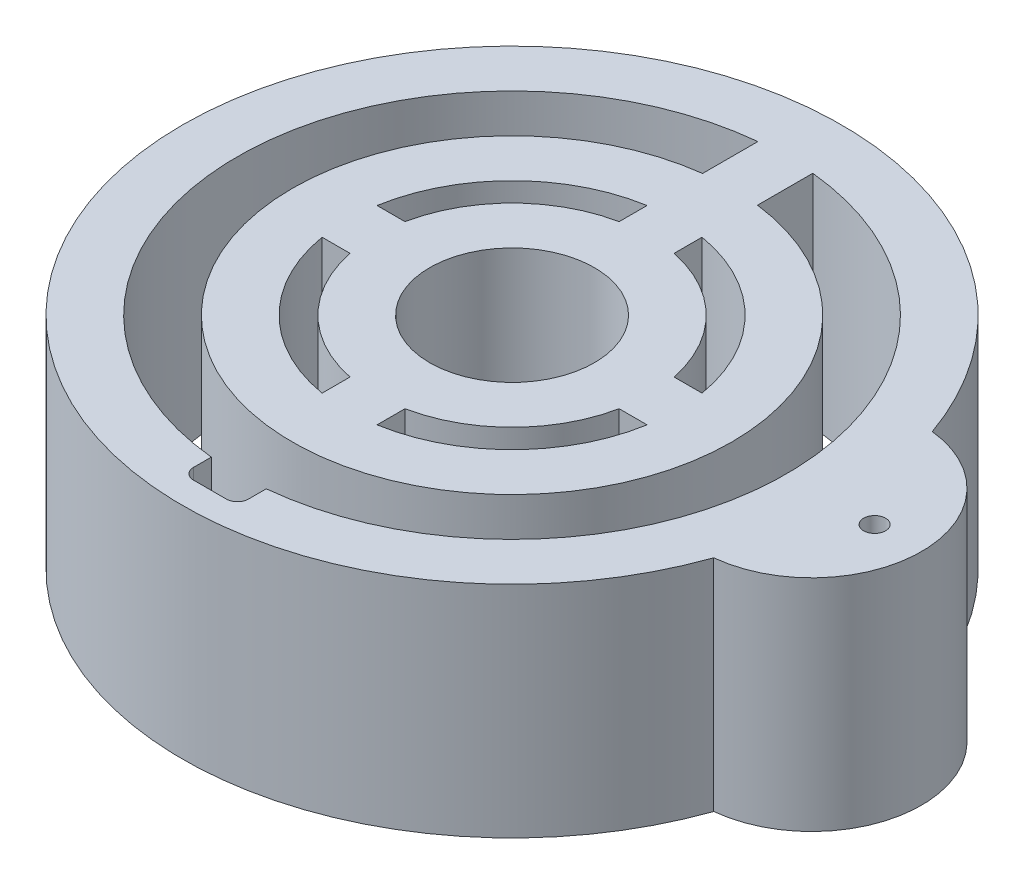
ISO-10303-21;
HEADER;
FILE_DESCRIPTION(('STEP AP214'),'2;1');
FILE_NAME('part.step','',(''),(''),'','','');
FILE_SCHEMA(('AUTOMOTIVE_DESIGN { 1 0 10303 214 1 1 1 1 }'));
ENDSEC;
DATA;
#1=APPLICATION_CONTEXT('core data for automotive mechanical design processes');
#2=APPLICATION_PROTOCOL_DEFINITION('international standard','automotive_design',2000,#1);
#3=PRODUCT_CONTEXT('',#1,'mechanical');
#4=PRODUCT('Part','Part','',(#3));
#5=PRODUCT_RELATED_PRODUCT_CATEGORY('part','',(#4));
#6=PRODUCT_DEFINITION_FORMATION('','',#4);
#7=PRODUCT_DEFINITION_CONTEXT('part definition',#1,'design');
#8=PRODUCT_DEFINITION('design','',#6,#7);
#9=PRODUCT_DEFINITION_SHAPE('','',#8);
#10=(LENGTH_UNIT() NAMED_UNIT(*) SI_UNIT(.MILLI.,.METRE.));
#11=(NAMED_UNIT(*) PLANE_ANGLE_UNIT() SI_UNIT($,.RADIAN.));
#12=(NAMED_UNIT(*) SI_UNIT($,.STERADIAN.) SOLID_ANGLE_UNIT());
#13=UNCERTAINTY_MEASURE_WITH_UNIT(LENGTH_MEASURE(1.E-05),#10,'distance_accuracy_value','');
#14=(GEOMETRIC_REPRESENTATION_CONTEXT(3) GLOBAL_UNCERTAINTY_ASSIGNED_CONTEXT((#13)) GLOBAL_UNIT_ASSIGNED_CONTEXT((#10,
#11,#12)) REPRESENTATION_CONTEXT('',''));
#15=CARTESIAN_POINT('',(0.,0.,0.));
#16=DIRECTION('',(0.,0.,1.));
#17=DIRECTION('',(1.,0.,0.));
#18=AXIS2_PLACEMENT_3D('',#15,#16,#17);
#19=CARTESIAN_POINT('',(0.,20.,0.));
#20=DIRECTION('',(0.,-1.,0.));
#21=DIRECTION('',(0.,0.,-1.));
#22=AXIS2_PLACEMENT_3D('',#19,#20,#21);
#23=CYLINDRICAL_SURFACE('',#22,15.);
#24=CARTESIAN_POINT('',(0.,0.,0.));
#25=DIRECTION('',(0.,1.,0.));
#26=DIRECTION('',(0.,0.,1.));
#27=AXIS2_PLACEMENT_3D('',#24,#25,#26);
#28=CIRCLE('',#27,15.);
#29=CARTESIAN_POINT('',(-2.5,0.,-14.790199457749));
#30=VERTEX_POINT('',#29);
#31=CARTESIAN_POINT('',(-14.790199457749,0.,-2.5));
#32=VERTEX_POINT('',#31);
#33=EDGE_CURVE('E454',#30,#32,#28,.T.);
#34=ORIENTED_EDGE('',*,*,#33,.F.);
#35=DIRECTION('',(0.,-1.,0.));
#36=VECTOR('',#35,1.);
#37=CARTESIAN_POINT('',(-2.5,20.,-14.790199457749));
#38=LINE('',#37,#36);
#39=CARTESIAN_POINT('',(-2.5,20.,-14.790199457749));
#40=VERTEX_POINT('',#39);
#41=EDGE_CURVE('E272',#30,#40,#38,.F.);
#42=ORIENTED_EDGE('',*,*,#41,.T.);
#43=CARTESIAN_POINT('',(0.,20.,0.));
#44=DIRECTION('',(0.,1.,0.));
#45=DIRECTION('',(0.,0.,1.));
#46=AXIS2_PLACEMENT_3D('',#43,#44,#45);
#47=CIRCLE('',#46,15.);
#48=CARTESIAN_POINT('',(-14.790199457749,20.,-2.5));
#49=VERTEX_POINT('',#48);
#50=EDGE_CURVE('E229',#40,#49,#47,.T.);
#51=ORIENTED_EDGE('',*,*,#50,.T.);
#52=DIRECTION('',(0.,-1.,0.));
#53=VECTOR('',#52,1.);
#54=CARTESIAN_POINT('',(-14.790199457749,20.,-2.5));
#55=LINE('',#54,#53);
#56=EDGE_CURVE('E269',#49,#32,#55,.T.);
#57=ORIENTED_EDGE('',*,*,#56,.T.);
#58=EDGE_LOOP('',(#34,#42,#51,#57));
#59=FACE_BOUND('',#58,.T.);
#60=ADVANCED_FACE('F38',(#59),#23,.F.);
#61=CARTESIAN_POINT('',(-14.790199457749,0.,2.5));
#62=VERTEX_POINT('',#61);
#63=CARTESIAN_POINT('',(-2.5,0.,14.790199457749));
#64=VERTEX_POINT('',#63);
#65=EDGE_CURVE('E352',#62,#64,#28,.T.);
#66=ORIENTED_EDGE('',*,*,#65,.F.);
#67=DIRECTION('',(0.,-1.,0.));
#68=VECTOR('',#67,1.);
#69=CARTESIAN_POINT('',(-14.790199457749,20.,2.5));
#70=LINE('',#69,#68);
#71=CARTESIAN_POINT('',(-14.790199457749,20.,2.5));
#72=VERTEX_POINT('',#71);
#73=EDGE_CURVE('E267',#62,#72,#70,.F.);
#74=ORIENTED_EDGE('',*,*,#73,.T.);
#75=CARTESIAN_POINT('',(-2.5,20.,14.790199457749));
#76=VERTEX_POINT('',#75);
#77=EDGE_CURVE('E317',#72,#76,#47,.T.);
#78=ORIENTED_EDGE('',*,*,#77,.T.);
#79=DIRECTION('',(0.,-1.,0.));
#80=VECTOR('',#79,1.);
#81=CARTESIAN_POINT('',(-2.5,20.,14.790199457749));
#82=LINE('',#81,#80);
#83=EDGE_CURVE('E264',#76,#64,#82,.T.);
#84=ORIENTED_EDGE('',*,*,#83,.T.);
#85=EDGE_LOOP('',(#66,#74,#78,#84));
#86=FACE_BOUND('',#85,.T.);
#87=ADVANCED_FACE('F430',(#86),#23,.F.);
#88=CARTESIAN_POINT('',(2.5,0.,14.790199457749));
#89=VERTEX_POINT('',#88);
#90=CARTESIAN_POINT('',(14.790199457749,0.,2.5));
#91=VERTEX_POINT('',#90);
#92=EDGE_CURVE('E353',#89,#91,#28,.T.);
#93=ORIENTED_EDGE('',*,*,#92,.F.);
#94=DIRECTION('',(0.,-1.,0.));
#95=VECTOR('',#94,1.);
#96=CARTESIAN_POINT('',(2.5,20.,14.790199457749));
#97=LINE('',#96,#95);
#98=CARTESIAN_POINT('',(2.5,20.,14.790199457749));
#99=VERTEX_POINT('',#98);
#100=EDGE_CURVE('E261',#89,#99,#97,.F.);
#101=ORIENTED_EDGE('',*,*,#100,.T.);
#102=CARTESIAN_POINT('',(14.790199457749,20.,2.5));
#103=VERTEX_POINT('',#102);
#104=EDGE_CURVE('E318',#99,#103,#47,.T.);
#105=ORIENTED_EDGE('',*,*,#104,.T.);
#106=DIRECTION('',(0.,-1.,0.));
#107=VECTOR('',#106,1.);
#108=CARTESIAN_POINT('',(14.790199457749,20.,2.5));
#109=LINE('',#108,#107);
#110=EDGE_CURVE('E258',#103,#91,#109,.T.);
#111=ORIENTED_EDGE('',*,*,#110,.T.);
#112=EDGE_LOOP('',(#93,#101,#105,#111));
#113=FACE_BOUND('',#112,.T.);
#114=ADVANCED_FACE('F436',(#113),#23,.F.);
#115=CARTESIAN_POINT('',(14.790199457749,0.,-2.5));
#116=VERTEX_POINT('',#115);
#117=CARTESIAN_POINT('',(2.5,0.,-14.790199457749));
#118=VERTEX_POINT('',#117);
#119=EDGE_CURVE('E356',#116,#118,#28,.T.);
#120=ORIENTED_EDGE('',*,*,#119,.F.);
#121=DIRECTION('',(0.,-1.,0.));
#122=VECTOR('',#121,1.);
#123=CARTESIAN_POINT('',(14.790199457749,20.,-2.5));
#124=LINE('',#123,#122);
#125=CARTESIAN_POINT('',(14.790199457749,20.,-2.5));
#126=VERTEX_POINT('',#125);
#127=EDGE_CURVE('E251',#116,#126,#124,.F.);
#128=ORIENTED_EDGE('',*,*,#127,.T.);
#129=CARTESIAN_POINT('',(2.5,20.,-14.790199457749));
#130=VERTEX_POINT('',#129);
#131=EDGE_CURVE('E322',#126,#130,#47,.T.);
#132=ORIENTED_EDGE('',*,*,#131,.T.);
#133=DIRECTION('',(0.,-1.,0.));
#134=VECTOR('',#133,1.);
#135=CARTESIAN_POINT('',(2.5,20.,-14.790199457749));
#136=LINE('',#135,#134);
#137=EDGE_CURVE('E248',#130,#118,#136,.T.);
#138=ORIENTED_EDGE('',*,*,#137,.T.);
#139=EDGE_LOOP('',(#120,#128,#132,#138));
#140=FACE_BOUND('',#139,.T.);
#141=ADVANCED_FACE('F427',(#140),#23,.F.);
#142=CARTESIAN_POINT('',(0.,20.,0.));
#143=DIRECTION('',(0.,-1.,0.));
#144=DIRECTION('',(0.,0.,-1.));
#145=AXIS2_PLACEMENT_3D('',#142,#143,#144);
#146=CYLINDRICAL_SURFACE('',#145,25.);
#147=CARTESIAN_POINT('',(0.,0.,0.));
#148=DIRECTION('',(0.,1.,0.));
#149=DIRECTION('',(0.,0.,1.));
#150=AXIS2_PLACEMENT_3D('',#147,#148,#149);
#151=CIRCLE('',#150,25.);
#152=CARTESIAN_POINT('',(-2.5,0.,-24.8746859276655));
#153=VERTEX_POINT('',#152);
#154=CARTESIAN_POINT('',(-2.5,0.,24.8746859276655));
#155=VERTEX_POINT('',#154);
#156=EDGE_CURVE('E290',#153,#155,#151,.T.);
#157=ORIENTED_EDGE('',*,*,#156,.F.);
#158=DIRECTION('',(0.,-1.,0.));
#159=VECTOR('',#158,1.);
#160=CARTESIAN_POINT('',(-2.5,20.,-24.8746859276655));
#161=LINE('',#160,#159);
#162=CARTESIAN_POINT('',(-2.5,20.,-24.8746859276655));
#163=VERTEX_POINT('',#162);
#164=EDGE_CURVE('E11',#163,#153,#161,.T.);
#165=ORIENTED_EDGE('',*,*,#164,.F.);
#166=CARTESIAN_POINT('',(0.,20.,0.));
#167=DIRECTION('',(0.,1.,0.));
#168=DIRECTION('',(0.,0.,1.));
#169=AXIS2_PLACEMENT_3D('',#166,#167,#168);
#170=CIRCLE('',#169,25.);
#171=CARTESIAN_POINT('',(-2.5,20.,24.8746859276655));
#172=VERTEX_POINT('',#171);
#173=EDGE_CURVE('E291',#163,#172,#170,.T.);
#174=ORIENTED_EDGE('',*,*,#173,.T.);
#175=DIRECTION('',(0.,-1.,0.));
#176=VECTOR('',#175,1.);
#177=CARTESIAN_POINT('',(-2.5,20.,24.8746859276655));
#178=LINE('',#177,#176);
#179=EDGE_CURVE('E325',#172,#155,#178,.T.);
#180=ORIENTED_EDGE('',*,*,#179,.T.);
#181=EDGE_LOOP('',(#157,#165,#174,#180));
#182=FACE_BOUND('',#181,.T.);
#183=ADVANCED_FACE('F421',(#182),#146,.F.);
#184=CARTESIAN_POINT('',(-2.5,20.,0.));
#185=DIRECTION('',(1.,0.,0.));
#186=DIRECTION('',(0.,0.,-1.));
#187=AXIS2_PLACEMENT_3D('',#184,#185,#186);
#188=PLANE('',#187);
#189=DIRECTION('',(0.,0.,1.));
#190=VECTOR('',#189,1.);
#191=CARTESIAN_POINT('',(-2.5,0.,0.));
#192=LINE('',#191,#190);
#193=CARTESIAN_POINT('',(-2.5,0.,-19.8431348329844));
#194=VERTEX_POINT('',#193);
#195=EDGE_CURVE('E328',#153,#194,#192,.T.);
#196=ORIENTED_EDGE('',*,*,#195,.T.);
#197=DIRECTION('',(0.,-1.,0.));
#198=VECTOR('',#197,1.);
#199=CARTESIAN_POINT('',(-2.5,20.,-19.8431348329844));
#200=LINE('',#199,#198);
#201=CARTESIAN_POINT('',(-2.5,20.,-19.8431348329844));
#202=VERTEX_POINT('',#201);
#203=EDGE_CURVE('E46',#202,#194,#200,.T.);
#204=ORIENTED_EDGE('',*,*,#203,.F.);
#205=DIRECTION('',(0.,0.,1.));
#206=VECTOR('',#205,1.);
#207=CARTESIAN_POINT('',(-2.5,20.,0.));
#208=LINE('',#207,#206);
#209=EDGE_CURVE('E294',#163,#202,#208,.T.);
#210=ORIENTED_EDGE('',*,*,#209,.F.);
#211=ORIENTED_EDGE('',*,*,#164,.T.);
#212=EDGE_LOOP('',(#196,#204,#210,#211));
#213=FACE_BOUND('',#212,.T.);
#214=ADVANCED_FACE('F40',(#213),#188,.F.);
#215=CARTESIAN_POINT('',(0.,20.,0.));
#216=DIRECTION('',(0.,-1.,0.));
#217=DIRECTION('',(0.,0.,-1.));
#218=AXIS2_PLACEMENT_3D('',#215,#216,#217);
#219=CYLINDRICAL_SURFACE('',#218,20.);
#220=CARTESIAN_POINT('',(0.,0.,0.));
#221=DIRECTION('',(0.,1.,0.));
#222=DIRECTION('',(0.,0.,1.));
#223=AXIS2_PLACEMENT_3D('',#220,#221,#222);
#224=CIRCLE('',#223,20.);
#225=CARTESIAN_POINT('',(2.5,0.,-19.8431348329844));
#226=VERTEX_POINT('',#225);
#227=EDGE_CURVE('E331',#194,#226,#224,.T.);
#228=ORIENTED_EDGE('',*,*,#227,.T.);
#229=DIRECTION('',(0.,-1.,0.));
#230=VECTOR('',#229,1.);
#231=CARTESIAN_POINT('',(2.5,20.,-19.8431348329844));
#232=LINE('',#231,#230);
#233=CARTESIAN_POINT('',(2.5,20.,-19.8431348329844));
#234=VERTEX_POINT('',#233);
#235=EDGE_CURVE('E372',#234,#226,#232,.T.);
#236=ORIENTED_EDGE('',*,*,#235,.F.);
#237=CARTESIAN_POINT('',(0.,20.,0.));
#238=DIRECTION('',(0.,1.,0.));
#239=DIRECTION('',(0.,0.,1.));
#240=AXIS2_PLACEMENT_3D('',#237,#238,#239);
#241=CIRCLE('',#240,20.);
#242=EDGE_CURVE('E298',#202,#234,#241,.T.);
#243=ORIENTED_EDGE('',*,*,#242,.F.);
#244=ORIENTED_EDGE('',*,*,#203,.T.);
#245=EDGE_LOOP('',(#228,#236,#243,#244));
#246=FACE_BOUND('',#245,.T.);
#247=ADVANCED_FACE('F378',(#246),#219,.T.);
#248=CARTESIAN_POINT('',(2.5,20.,0.));
#249=DIRECTION('',(1.,0.,0.));
#250=DIRECTION('',(0.,0.,-1.));
#251=AXIS2_PLACEMENT_3D('',#248,#249,#250);
#252=PLANE('',#251);
#253=DIRECTION('',(0.,0.,1.));
#254=VECTOR('',#253,1.);
#255=CARTESIAN_POINT('',(2.5,0.,0.));
#256=LINE('',#255,#254);
#257=CARTESIAN_POINT('',(2.5,0.,-24.8746859276655));
#258=VERTEX_POINT('',#257);
#259=EDGE_CURVE('E334',#258,#226,#256,.T.);
#260=ORIENTED_EDGE('',*,*,#259,.F.);
#261=DIRECTION('',(0.,-1.,0.));
#262=VECTOR('',#261,1.);
#263=CARTESIAN_POINT('',(2.5,20.,-24.8746859276655));
#264=LINE('',#263,#262);
#265=CARTESIAN_POINT('',(2.5,20.,-24.8746859276655));
#266=VERTEX_POINT('',#265);
#267=EDGE_CURVE('E370',#266,#258,#264,.T.);
#268=ORIENTED_EDGE('',*,*,#267,.F.);
#269=DIRECTION('',(0.,0.,1.));
#270=VECTOR('',#269,1.);
#271=CARTESIAN_POINT('',(2.5,20.,0.));
#272=LINE('',#271,#270);
#273=EDGE_CURVE('E300',#266,#234,#272,.T.);
#274=ORIENTED_EDGE('',*,*,#273,.T.);
#275=ORIENTED_EDGE('',*,*,#235,.T.);
#276=EDGE_LOOP('',(#260,#268,#274,#275));
#277=FACE_BOUND('',#276,.T.);
#278=ADVANCED_FACE('F392',(#277),#252,.T.);
#279=CARTESIAN_POINT('',(2.5,0.,24.8746859276655));
#280=VERTEX_POINT('',#279);
#281=EDGE_CURVE('E329',#280,#258,#151,.T.);
#282=ORIENTED_EDGE('',*,*,#281,.F.);
#283=DIRECTION('',(0.,-1.,0.));
#284=VECTOR('',#283,1.);
#285=CARTESIAN_POINT('',(2.5,20.,24.8746859276655));
#286=LINE('',#285,#284);
#287=CARTESIAN_POINT('',(2.5,20.,24.8746859276655));
#288=VERTEX_POINT('',#287);
#289=EDGE_CURVE('E368',#288,#280,#286,.T.);
#290=ORIENTED_EDGE('',*,*,#289,.F.);
#291=EDGE_CURVE('E296',#288,#266,#170,.T.);
#292=ORIENTED_EDGE('',*,*,#291,.T.);
#293=ORIENTED_EDGE('',*,*,#267,.T.);
#294=EDGE_LOOP('',(#282,#290,#292,#293));
#295=FACE_BOUND('',#294,.T.);
#296=ADVANCED_FACE('F399',(#295),#146,.F.);
#297=CARTESIAN_POINT('',(2.5,20.,0.));
#298=DIRECTION('',(1.,0.,0.));
#299=DIRECTION('',(0.,0.,-1.));
#300=AXIS2_PLACEMENT_3D('',#297,#298,#299);
#301=PLANE('',#300);
#302=DIRECTION('',(0.,0.,1.));
#303=VECTOR('',#302,1.);
#304=CARTESIAN_POINT('',(2.5,0.,0.));
#305=LINE('',#304,#303);
#306=CARTESIAN_POINT('',(2.5,0.,26.5));
#307=VERTEX_POINT('',#306);
#308=EDGE_CURVE('E337',#280,#307,#305,.T.);
#309=ORIENTED_EDGE('',*,*,#308,.T.);
#310=DIRECTION('',(0.,-1.,0.));
#311=VECTOR('',#310,1.);
#312=CARTESIAN_POINT('',(2.5,20.,26.5));
#313=LINE('',#312,#311);
#314=CARTESIAN_POINT('',(2.5,20.,26.5));
#315=VERTEX_POINT('',#314);
#316=EDGE_CURVE('E366',#315,#307,#313,.T.);
#317=ORIENTED_EDGE('',*,*,#316,.F.);
#318=DIRECTION('',(0.,0.,1.));
#319=VECTOR('',#318,1.);
#320=CARTESIAN_POINT('',(2.5,20.,0.));
#321=LINE('',#320,#319);
#322=EDGE_CURVE('E303',#288,#315,#321,.T.);
#323=ORIENTED_EDGE('',*,*,#322,.F.);
#324=ORIENTED_EDGE('',*,*,#289,.T.);
#325=EDGE_LOOP('',(#309,#317,#323,#324));
#326=FACE_BOUND('',#325,.T.);
#327=ADVANCED_FACE('F403',(#326),#301,.F.);
#328=CARTESIAN_POINT('',(1.5,20.,26.5));
#329=DIRECTION('',(0.,-1.,0.));
#330=DIRECTION('',(0.,0.,-1.));
#331=AXIS2_PLACEMENT_3D('',#328,#329,#330);
#332=CYLINDRICAL_SURFACE('',#331,1.);
#333=CARTESIAN_POINT('',(1.5,0.,26.5));
#334=DIRECTION('',(0.,1.,0.));
#335=DIRECTION('',(0.,0.,1.));
#336=AXIS2_PLACEMENT_3D('',#333,#334,#335);
#337=CIRCLE('',#336,1.);
#338=CARTESIAN_POINT('',(1.5,0.,27.5));
#339=VERTEX_POINT('',#338);
#340=EDGE_CURVE('E340',#339,#307,#337,.T.);
#341=ORIENTED_EDGE('',*,*,#340,.F.);
#342=DIRECTION('',(0.,-1.,0.));
#343=VECTOR('',#342,1.);
#344=CARTESIAN_POINT('',(1.5,20.,27.5));
#345=LINE('',#344,#343);
#346=CARTESIAN_POINT('',(1.5,20.,27.5));
#347=VERTEX_POINT('',#346);
#348=EDGE_CURVE('E364',#347,#339,#345,.T.);
#349=ORIENTED_EDGE('',*,*,#348,.F.);
#350=CARTESIAN_POINT('',(1.5,20.,26.5));
#351=DIRECTION('',(0.,1.,0.));
#352=DIRECTION('',(0.,0.,1.));
#353=AXIS2_PLACEMENT_3D('',#350,#351,#352);
#354=CIRCLE('',#353,1.);
#355=EDGE_CURVE('E305',#347,#315,#354,.T.);
#356=ORIENTED_EDGE('',*,*,#355,.T.);
#357=ORIENTED_EDGE('',*,*,#316,.T.);
#358=EDGE_LOOP('',(#341,#349,#356,#357));
#359=FACE_BOUND('',#358,.T.);
#360=ADVANCED_FACE('F761',(#359),#332,.F.);
#361=CARTESIAN_POINT('',(0.,20.,27.5));
#362=DIRECTION('',(0.,0.,-1.));
#363=DIRECTION('',(-1.,0.,0.));
#364=AXIS2_PLACEMENT_3D('',#361,#362,#363);
#365=PLANE('',#364);
#366=DIRECTION('',(1.,0.,0.));
#367=VECTOR('',#366,1.);
#368=CARTESIAN_POINT('',(0.,0.,27.5));
#369=LINE('',#368,#367);
#370=CARTESIAN_POINT('',(-1.49999999999999,0.,27.5));
#371=VERTEX_POINT('',#370);
#372=EDGE_CURVE('E343',#371,#339,#369,.T.);
#373=ORIENTED_EDGE('',*,*,#372,.F.);
#374=DIRECTION('',(0.,-1.,0.));
#375=VECTOR('',#374,1.);
#376=CARTESIAN_POINT('',(-1.49999999999999,20.,27.5));
#377=LINE('',#376,#375);
#378=CARTESIAN_POINT('',(-1.49999999999999,20.,27.5));
#379=VERTEX_POINT('',#378);
#380=EDGE_CURVE('E362',#379,#371,#377,.T.);
#381=ORIENTED_EDGE('',*,*,#380,.F.);
#382=DIRECTION('',(1.,0.,0.));
#383=VECTOR('',#382,1.);
#384=CARTESIAN_POINT('',(0.,20.,27.5));
#385=LINE('',#384,#383);
#386=EDGE_CURVE('E308',#379,#347,#385,.T.);
#387=ORIENTED_EDGE('',*,*,#386,.T.);
#388=ORIENTED_EDGE('',*,*,#348,.T.);
#389=EDGE_LOOP('',(#373,#381,#387,#388));
#390=FACE_BOUND('',#389,.T.);
#391=ADVANCED_FACE('F410',(#390),#365,.T.);
#392=CARTESIAN_POINT('',(-1.5,20.,26.5));
#393=DIRECTION('',(0.,-1.,0.));
#394=DIRECTION('',(0.,0.,-1.));
#395=AXIS2_PLACEMENT_3D('',#392,#393,#394);
#396=CYLINDRICAL_SURFACE('',#395,1.);
#397=CARTESIAN_POINT('',(-1.5,0.,26.5));
#398=DIRECTION('',(0.,1.,0.));
#399=DIRECTION('',(0.,0.,1.));
#400=AXIS2_PLACEMENT_3D('',#397,#398,#399);
#401=CIRCLE('',#400,1.);
#402=CARTESIAN_POINT('',(-2.5,0.,26.5));
#403=VERTEX_POINT('',#402);
#404=EDGE_CURVE('E346',#403,#371,#401,.T.);
#405=ORIENTED_EDGE('',*,*,#404,.F.);
#406=DIRECTION('',(0.,-1.,0.));
#407=VECTOR('',#406,1.);
#408=CARTESIAN_POINT('',(-2.5,20.,26.5));
#409=LINE('',#408,#407);
#410=CARTESIAN_POINT('',(-2.5,20.,26.5));
#411=VERTEX_POINT('',#410);
#412=EDGE_CURVE('E360',#411,#403,#409,.T.);
#413=ORIENTED_EDGE('',*,*,#412,.F.);
#414=CARTESIAN_POINT('',(-1.5,20.,26.5));
#415=DIRECTION('',(0.,1.,0.));
#416=DIRECTION('',(0.,0.,1.));
#417=AXIS2_PLACEMENT_3D('',#414,#415,#416);
#418=CIRCLE('',#417,1.);
#419=EDGE_CURVE('E311',#411,#379,#418,.T.);
#420=ORIENTED_EDGE('',*,*,#419,.T.);
#421=ORIENTED_EDGE('',*,*,#380,.T.);
#422=EDGE_LOOP('',(#405,#413,#420,#421));
#423=FACE_BOUND('',#422,.T.);
#424=ADVANCED_FACE('F414',(#423),#396,.F.);
#425=CARTESIAN_POINT('',(-2.5,20.,0.));
#426=DIRECTION('',(1.,0.,0.));
#427=DIRECTION('',(0.,0.,-1.));
#428=AXIS2_PLACEMENT_3D('',#425,#426,#427);
#429=PLANE('',#428);
#430=DIRECTION('',(0.,0.,1.));
#431=VECTOR('',#430,1.);
#432=CARTESIAN_POINT('',(-2.5,0.,0.));
#433=LINE('',#432,#431);
#434=EDGE_CURVE('E349',#155,#403,#433,.T.);
#435=ORIENTED_EDGE('',*,*,#434,.F.);
#436=ORIENTED_EDGE('',*,*,#179,.F.);
#437=DIRECTION('',(0.,0.,1.));
#438=VECTOR('',#437,1.);
#439=CARTESIAN_POINT('',(-2.5,20.,0.));
#440=LINE('',#439,#438);
#441=EDGE_CURVE('E314',#172,#411,#440,.T.);
#442=ORIENTED_EDGE('',*,*,#441,.T.);
#443=ORIENTED_EDGE('',*,*,#412,.T.);
#444=EDGE_LOOP('',(#435,#436,#442,#443));
#445=FACE_BOUND('',#444,.T.);
#446=ADVANCED_FACE('F419',(#445),#429,.T.);
#447=CARTESIAN_POINT('',(0.,20.,0.));
#448=DIRECTION('',(0.,-1.,0.));
#449=DIRECTION('',(0.,0.,-1.));
#450=AXIS2_PLACEMENT_3D('',#447,#448,#449);
#451=CYLINDRICAL_SURFACE('',#450,30.);
#452=CARTESIAN_POINT('',(0.,0.,0.));
#453=DIRECTION('',(0.,1.,0.));
#454=DIRECTION('',(0.,0.,1.));
#455=AXIS2_PLACEMENT_3D('',#452,#453,#454);
#456=CIRCLE('',#455,30.);
#457=CARTESIAN_POINT('',(28.303066095746,0.,-9.94668032962917));
#458=VERTEX_POINT('',#457);
#459=CARTESIAN_POINT('',(28.303066095746,0.,9.94668032962917));
#460=VERTEX_POINT('',#459);
#461=EDGE_CURVE('E295',#458,#460,#456,.T.);
#462=ORIENTED_EDGE('',*,*,#461,.T.);
#463=DIRECTION('',(0.,1.,0.));
#464=VECTOR('',#463,1.);
#465=CARTESIAN_POINT('',(28.303066095746,10.,9.94668032962917));
#466=LINE('',#465,#464);
#467=CARTESIAN_POINT('',(28.303066095746,20.,9.94668032962917));
#468=VERTEX_POINT('',#467);
#469=EDGE_CURVE('E287',#460,#468,#466,.T.);
#470=ORIENTED_EDGE('',*,*,#469,.T.);
#471=CARTESIAN_POINT('',(0.,20.,0.));
#472=DIRECTION('',(0.,1.,0.));
#473=DIRECTION('',(0.,0.,1.));
#474=AXIS2_PLACEMENT_3D('',#471,#472,#473);
#475=CIRCLE('',#474,30.);
#476=CARTESIAN_POINT('',(28.303066095746,20.,-9.94668032962917));
#477=VERTEX_POINT('',#476);
#478=EDGE_CURVE('E321',#477,#468,#475,.T.);
#479=ORIENTED_EDGE('',*,*,#478,.F.);
#480=DIRECTION('',(0.,1.,0.));
#481=VECTOR('',#480,1.);
#482=CARTESIAN_POINT('',(28.303066095746,10.,-9.94668032962917));
#483=LINE('',#482,#481);
#484=EDGE_CURVE('E283',#477,#458,#483,.F.);
#485=ORIENTED_EDGE('',*,*,#484,.T.);
#486=EDGE_LOOP('',(#462,#470,#479,#485));
#487=FACE_BOUND('',#486,.T.);
#488=ADVANCED_FACE('F558',(#487),#451,.T.);
#489=CARTESIAN_POINT('',(0.,20.,0.));
#490=DIRECTION('',(0.,1.,0.));
#491=DIRECTION('',(0.,0.,1.));
#492=AXIS2_PLACEMENT_3D('',#489,#490,#491);
#493=PLANE('',#492);
#494=ORIENTED_EDGE('',*,*,#131,.F.);
#495=DIRECTION('',(-1.,0.,0.));
#496=VECTOR('',#495,1.);
#497=CARTESIAN_POINT('',(12.2474487139159,20.,-2.5));
#498=LINE('',#497,#496);
#499=CARTESIAN_POINT('',(12.2474487139159,20.,-2.5));
#500=VERTEX_POINT('',#499);
#501=EDGE_CURVE('E61',#126,#500,#498,.T.);
#502=ORIENTED_EDGE('',*,*,#501,.T.);
#503=CARTESIAN_POINT('',(0.,20.,0.));
#504=DIRECTION('',(0.,1.,0.));
#505=DIRECTION('',(0.,0.,1.));
#506=AXIS2_PLACEMENT_3D('',#503,#504,#505);
#507=CIRCLE('',#506,12.5);
#508=CARTESIAN_POINT('',(2.5,20.,-12.2474487139159));
#509=VERTEX_POINT('',#508);
#510=EDGE_CURVE('E489',#500,#509,#507,.T.);
#511=ORIENTED_EDGE('',*,*,#510,.T.);
#512=DIRECTION('',(0.,0.,-1.));
#513=VECTOR('',#512,1.);
#514=CARTESIAN_POINT('',(2.5,20.,-19.8431348329844));
#515=LINE('',#514,#513);
#516=EDGE_CURVE('E491',#509,#130,#515,.T.);
#517=ORIENTED_EDGE('',*,*,#516,.T.);
#518=EDGE_LOOP('',(#494,#502,#511,#517));
#519=FACE_BOUND('',#518,.T.);
#520=ORIENTED_EDGE('',*,*,#50,.F.);
#521=DIRECTION('',(0.,0.,1.));
#522=VECTOR('',#521,1.);
#523=CARTESIAN_POINT('',(-2.5,20.,-19.8431348329844));
#524=LINE('',#523,#522);
#525=CARTESIAN_POINT('',(-2.5,20.,-12.2474487139159));
#526=VERTEX_POINT('',#525);
#527=EDGE_CURVE('E221',#40,#526,#524,.T.);
#528=ORIENTED_EDGE('',*,*,#527,.T.);
#529=CARTESIAN_POINT('',(0.,20.,0.));
#530=DIRECTION('',(0.,1.,0.));
#531=DIRECTION('',(0.,0.,1.));
#532=AXIS2_PLACEMENT_3D('',#529,#530,#531);
#533=CIRCLE('',#532,12.5);
#534=CARTESIAN_POINT('',(-12.2474487139159,20.,-2.5));
#535=VERTEX_POINT('',#534);
#536=EDGE_CURVE('E226',#526,#535,#533,.T.);
#537=ORIENTED_EDGE('',*,*,#536,.T.);
#538=DIRECTION('',(-1.,0.,0.));
#539=VECTOR('',#538,1.);
#540=CARTESIAN_POINT('',(-12.2474487139159,20.,-2.5));
#541=LINE('',#540,#539);
#542=EDGE_CURVE('E242',#535,#49,#541,.T.);
#543=ORIENTED_EDGE('',*,*,#542,.T.);
#544=EDGE_LOOP('',(#520,#528,#537,#543));
#545=FACE_BOUND('',#544,.T.);
#546=ORIENTED_EDGE('',*,*,#77,.F.);
#547=DIRECTION('',(1.,0.,0.));
#548=VECTOR('',#547,1.);
#549=CARTESIAN_POINT('',(-12.2474487139159,20.,2.5));
#550=LINE('',#549,#548);
#551=CARTESIAN_POINT('',(-12.2474487139159,20.,2.5));
#552=VERTEX_POINT('',#551);
#553=EDGE_CURVE('E53',#72,#552,#550,.T.);
#554=ORIENTED_EDGE('',*,*,#553,.T.);
#555=CARTESIAN_POINT('',(0.,20.,0.));
#556=DIRECTION('',(0.,1.,0.));
#557=DIRECTION('',(0.,0.,1.));
#558=AXIS2_PLACEMENT_3D('',#555,#556,#557);
#559=CIRCLE('',#558,12.5);
#560=CARTESIAN_POINT('',(-2.5,20.,12.2474487139159));
#561=VERTEX_POINT('',#560);
#562=EDGE_CURVE('E475',#552,#561,#559,.T.);
#563=ORIENTED_EDGE('',*,*,#562,.T.);
#564=DIRECTION('',(0.,0.,1.));
#565=VECTOR('',#564,1.);
#566=CARTESIAN_POINT('',(-2.5,20.,12.2474487139159));
#567=LINE('',#566,#565);
#568=EDGE_CURVE('E473',#561,#76,#567,.T.);
#569=ORIENTED_EDGE('',*,*,#568,.T.);
#570=EDGE_LOOP('',(#546,#554,#563,#569));
#571=FACE_BOUND('',#570,.T.);
#572=ORIENTED_EDGE('',*,*,#209,.T.);
#573=ORIENTED_EDGE('',*,*,#242,.T.);
#574=ORIENTED_EDGE('',*,*,#273,.F.);
#575=ORIENTED_EDGE('',*,*,#291,.F.);
#576=ORIENTED_EDGE('',*,*,#322,.T.);
#577=ORIENTED_EDGE('',*,*,#355,.F.);
#578=ORIENTED_EDGE('',*,*,#386,.F.);
#579=ORIENTED_EDGE('',*,*,#419,.F.);
#580=ORIENTED_EDGE('',*,*,#441,.F.);
#581=ORIENTED_EDGE('',*,*,#173,.F.);
#582=EDGE_LOOP('',(#572,#573,#574,#575,#576,#577,#578,#579,#580,#581));
#583=FACE_BOUND('',#582,.T.);
#584=DIRECTION('',(1.,0.,0.));
#585=VECTOR('',#584,1.);
#586=CARTESIAN_POINT('',(12.2474487139159,20.,2.5));
#587=LINE('',#586,#585);
#588=CARTESIAN_POINT('',(12.2474487139159,20.,2.5));
#589=VERTEX_POINT('',#588);
#590=EDGE_CURVE('E485',#589,#103,#587,.T.);
#591=ORIENTED_EDGE('',*,*,#590,.T.);
#592=ORIENTED_EDGE('',*,*,#104,.F.);
#593=DIRECTION('',(0.,0.,-1.));
#594=VECTOR('',#593,1.);
#595=CARTESIAN_POINT('',(2.5,20.,12.2474487139159));
#596=LINE('',#595,#594);
#597=CARTESIAN_POINT('',(2.5,20.,12.2474487139159));
#598=VERTEX_POINT('',#597);
#599=EDGE_CURVE('E477',#99,#598,#596,.T.);
#600=ORIENTED_EDGE('',*,*,#599,.T.);
#601=CARTESIAN_POINT('',(0.,20.,0.));
#602=DIRECTION('',(0.,1.,0.));
#603=DIRECTION('',(0.,0.,1.));
#604=AXIS2_PLACEMENT_3D('',#601,#602,#603);
#605=CIRCLE('',#604,12.5);
#606=EDGE_CURVE('E479',#598,#589,#605,.T.);
#607=ORIENTED_EDGE('',*,*,#606,.T.);
#608=EDGE_LOOP('',(#591,#592,#600,#607));
#609=FACE_BOUND('',#608,.T.);
#610=ORIENTED_EDGE('',*,*,#478,.T.);
#611=CARTESIAN_POINT('',(27.2717802865893,20.,0.));
#612=DIRECTION('',(0.,1.,0.));
#613=DIRECTION('',(0.,0.,-1.));
#614=AXIS2_PLACEMENT_3D('',#611,#612,#613);
#615=CIRCLE('',#614,10.);
#616=EDGE_CURVE('E278',#468,#477,#615,.T.);
#617=ORIENTED_EDGE('',*,*,#616,.T.);
#618=EDGE_LOOP('',(#610,#617));
#619=FACE_BOUND('',#618,.T.);
#620=CARTESIAN_POINT('',(33.,20.,0.));
#621=DIRECTION('',(0.,1.,0.));
#622=DIRECTION('',(0.,0.,1.));
#623=AXIS2_PLACEMENT_3D('',#620,#621,#622);
#624=CIRCLE('',#623,0.999999999999998);
#625=CARTESIAN_POINT('',(33.,20.,0.999999999999998));
#626=VERTEX_POINT('',#625);
#627=EDGE_CURVE('E274',#626,#626,#624,.T.);
#628=ORIENTED_EDGE('',*,*,#627,.F.);
#629=EDGE_LOOP('',(#628));
#630=FACE_BOUND('',#629,.T.);
#631=CARTESIAN_POINT('',(0.,20.,0.));
#632=DIRECTION('',(0.,1.,0.));
#633=DIRECTION('',(0.,0.,1.));
#634=AXIS2_PLACEMENT_3D('',#631,#632,#633);
#635=CIRCLE('',#634,7.5);
#636=CARTESIAN_POINT('',(0.,20.,7.5));
#637=VERTEX_POINT('',#636);
#638=EDGE_CURVE('E497',#637,#637,#635,.T.);
#639=ORIENTED_EDGE('',*,*,#638,.F.);
#640=EDGE_LOOP('',(#639));
#641=FACE_BOUND('',#640,.T.);
#642=ADVANCED_FACE('F223',(#519,#545,#571,#583,#609,#619,#630,#641),#493,.T.);
#643=CARTESIAN_POINT('',(0.,0.,0.));
#644=DIRECTION('',(0.,1.,0.));
#645=DIRECTION('',(0.,0.,1.));
#646=AXIS2_PLACEMENT_3D('',#643,#644,#645);
#647=PLANE('',#646);
#648=DIRECTION('',(-1.,0.,0.));
#649=VECTOR('',#648,1.);
#650=CARTESIAN_POINT('',(12.2474487139159,0.,-2.5));
#651=LINE('',#650,#649);
#652=CARTESIAN_POINT('',(12.2474487139159,0.,-2.5));
#653=VERTEX_POINT('',#652);
#654=EDGE_CURVE('E511',#116,#653,#651,.T.);
#655=ORIENTED_EDGE('',*,*,#654,.F.);
#656=ORIENTED_EDGE('',*,*,#119,.T.);
#657=DIRECTION('',(0.,0.,-1.));
#658=VECTOR('',#657,1.);
#659=CARTESIAN_POINT('',(2.5,0.,-19.8431348329844));
#660=LINE('',#659,#658);
#661=CARTESIAN_POINT('',(2.5,0.,-12.2474487139159));
#662=VERTEX_POINT('',#661);
#663=EDGE_CURVE('E233',#662,#118,#660,.T.);
#664=ORIENTED_EDGE('',*,*,#663,.F.);
#665=CARTESIAN_POINT('',(0.,0.,0.));
#666=DIRECTION('',(0.,1.,0.));
#667=DIRECTION('',(0.,0.,1.));
#668=AXIS2_PLACEMENT_3D('',#665,#666,#667);
#669=CIRCLE('',#668,12.5);
#670=EDGE_CURVE('E513',#653,#662,#669,.T.);
#671=ORIENTED_EDGE('',*,*,#670,.F.);
#672=EDGE_LOOP('',(#655,#656,#664,#671));
#673=FACE_BOUND('',#672,.T.);
#674=DIRECTION('',(0.,0.,1.));
#675=VECTOR('',#674,1.);
#676=CARTESIAN_POINT('',(-2.5,0.,-19.8431348329844));
#677=LINE('',#676,#675);
#678=CARTESIAN_POINT('',(-2.5,0.,-12.2474487139159));
#679=VERTEX_POINT('',#678);
#680=EDGE_CURVE('E246',#30,#679,#677,.T.);
#681=ORIENTED_EDGE('',*,*,#680,.F.);
#682=ORIENTED_EDGE('',*,*,#33,.T.);
#683=DIRECTION('',(-1.,0.,0.));
#684=VECTOR('',#683,1.);
#685=CARTESIAN_POINT('',(-12.2474487139159,0.,-2.5));
#686=LINE('',#685,#684);
#687=CARTESIAN_POINT('',(-12.2474487139159,0.,-2.5));
#688=VERTEX_POINT('',#687);
#689=EDGE_CURVE('E499',#688,#32,#686,.T.);
#690=ORIENTED_EDGE('',*,*,#689,.F.);
#691=CARTESIAN_POINT('',(0.,0.,0.));
#692=DIRECTION('',(0.,1.,0.));
#693=DIRECTION('',(0.,0.,1.));
#694=AXIS2_PLACEMENT_3D('',#691,#692,#693);
#695=CIRCLE('',#694,12.5);
#696=EDGE_CURVE('E496',#679,#688,#695,.T.);
#697=ORIENTED_EDGE('',*,*,#696,.F.);
#698=EDGE_LOOP('',(#681,#682,#690,#697));
#699=FACE_BOUND('',#698,.T.);
#700=DIRECTION('',(1.,0.,0.));
#701=VECTOR('',#700,1.);
#702=CARTESIAN_POINT('',(-12.2474487139159,0.,2.5));
#703=LINE('',#702,#701);
#704=CARTESIAN_POINT('',(-12.2474487139159,0.,2.5));
#705=VERTEX_POINT('',#704);
#706=EDGE_CURVE('E465',#62,#705,#703,.T.);
#707=ORIENTED_EDGE('',*,*,#706,.F.);
#708=ORIENTED_EDGE('',*,*,#65,.T.);
#709=DIRECTION('',(0.,0.,1.));
#710=VECTOR('',#709,1.);
#711=CARTESIAN_POINT('',(-2.5,0.,12.2474487139159));
#712=LINE('',#711,#710);
#713=CARTESIAN_POINT('',(-2.5,0.,12.2474487139159));
#714=VERTEX_POINT('',#713);
#715=EDGE_CURVE('E464',#714,#64,#712,.T.);
#716=ORIENTED_EDGE('',*,*,#715,.F.);
#717=CARTESIAN_POINT('',(0.,0.,0.));
#718=DIRECTION('',(0.,1.,0.));
#719=DIRECTION('',(0.,0.,1.));
#720=AXIS2_PLACEMENT_3D('',#717,#718,#719);
#721=CIRCLE('',#720,12.5);
#722=EDGE_CURVE('E502',#705,#714,#721,.T.);
#723=ORIENTED_EDGE('',*,*,#722,.F.);
#724=EDGE_LOOP('',(#707,#708,#716,#723));
#725=FACE_BOUND('',#724,.T.);
#726=ORIENTED_EDGE('',*,*,#227,.F.);
#727=ORIENTED_EDGE('',*,*,#195,.F.);
#728=ORIENTED_EDGE('',*,*,#156,.T.);
#729=ORIENTED_EDGE('',*,*,#434,.T.);
#730=ORIENTED_EDGE('',*,*,#404,.T.);
#731=ORIENTED_EDGE('',*,*,#372,.T.);
#732=ORIENTED_EDGE('',*,*,#340,.T.);
#733=ORIENTED_EDGE('',*,*,#308,.F.);
#734=ORIENTED_EDGE('',*,*,#281,.T.);
#735=ORIENTED_EDGE('',*,*,#259,.T.);
#736=EDGE_LOOP('',(#726,#727,#728,#729,#730,#731,#732,#733,#734,#735));
#737=FACE_BOUND('',#736,.T.);
#738=ORIENTED_EDGE('',*,*,#92,.T.);
#739=DIRECTION('',(1.,0.,0.));
#740=VECTOR('',#739,1.);
#741=CARTESIAN_POINT('',(12.2474487139159,0.,2.5));
#742=LINE('',#741,#740);
#743=CARTESIAN_POINT('',(12.2474487139159,0.,2.5));
#744=VERTEX_POINT('',#743);
#745=EDGE_CURVE('E509',#744,#91,#742,.T.);
#746=ORIENTED_EDGE('',*,*,#745,.F.);
#747=CARTESIAN_POINT('',(0.,0.,0.));
#748=DIRECTION('',(0.,1.,0.));
#749=DIRECTION('',(0.,0.,1.));
#750=AXIS2_PLACEMENT_3D('',#747,#748,#749);
#751=CIRCLE('',#750,12.5);
#752=CARTESIAN_POINT('',(2.5,0.,12.2474487139159));
#753=VERTEX_POINT('',#752);
#754=EDGE_CURVE('E507',#753,#744,#751,.T.);
#755=ORIENTED_EDGE('',*,*,#754,.F.);
#756=DIRECTION('',(0.,0.,-1.));
#757=VECTOR('',#756,1.);
#758=CARTESIAN_POINT('',(2.5,0.,12.2474487139159));
#759=LINE('',#758,#757);
#760=EDGE_CURVE('E505',#89,#753,#759,.T.);
#761=ORIENTED_EDGE('',*,*,#760,.F.);
#762=EDGE_LOOP('',(#738,#746,#755,#761));
#763=FACE_BOUND('',#762,.T.);
#764=ORIENTED_EDGE('',*,*,#461,.F.);
#765=CARTESIAN_POINT('',(27.2717802865893,0.,0.));
#766=DIRECTION('',(0.,1.,0.));
#767=DIRECTION('',(0.,0.,-1.));
#768=AXIS2_PLACEMENT_3D('',#765,#766,#767);
#769=CIRCLE('',#768,10.);
#770=EDGE_CURVE('E281',#460,#458,#769,.T.);
#771=ORIENTED_EDGE('',*,*,#770,.F.);
#772=EDGE_LOOP('',(#764,#771));
#773=FACE_BOUND('',#772,.T.);
#774=CARTESIAN_POINT('',(33.,0.,0.));
#775=DIRECTION('',(0.,1.,0.));
#776=DIRECTION('',(0.,0.,1.));
#777=AXIS2_PLACEMENT_3D('',#774,#775,#776);
#778=CIRCLE('',#777,0.999999999999998);
#779=CARTESIAN_POINT('',(33.,0.,0.999999999999998));
#780=VERTEX_POINT('',#779);
#781=EDGE_CURVE('E275',#780,#780,#778,.T.);
#782=ORIENTED_EDGE('',*,*,#781,.T.);
#783=EDGE_LOOP('',(#782));
#784=FACE_BOUND('',#783,.T.);
#785=CARTESIAN_POINT('',(0.,0.,0.));
#786=DIRECTION('',(0.,1.,0.));
#787=DIRECTION('',(0.,0.,1.));
#788=AXIS2_PLACEMENT_3D('',#785,#786,#787);
#789=CIRCLE('',#788,7.5);
#790=CARTESIAN_POINT('',(0.,0.,7.5));
#791=VERTEX_POINT('',#790);
#792=EDGE_CURVE('E579',#791,#791,#789,.T.);
#793=ORIENTED_EDGE('',*,*,#792,.T.);
#794=EDGE_LOOP('',(#793));
#795=FACE_BOUND('',#794,.T.);
#796=ADVANCED_FACE('F384',(#673,#699,#725,#737,#763,#773,#784,#795),#647,.F.);
#797=CARTESIAN_POINT('',(27.2717802865893,0.,0.));
#798=DIRECTION('',(0.,1.,0.));
#799=DIRECTION('',(0.,0.,1.));
#800=AXIS2_PLACEMENT_3D('',#797,#798,#799);
#801=CYLINDRICAL_SURFACE('',#800,10.);
#802=ORIENTED_EDGE('',*,*,#469,.F.);
#803=ORIENTED_EDGE('',*,*,#770,.T.);
#804=ORIENTED_EDGE('',*,*,#484,.F.);
#805=ORIENTED_EDGE('',*,*,#616,.F.);
#806=EDGE_LOOP('',(#802,#803,#804,#805));
#807=FACE_BOUND('',#806,.T.);
#808=ADVANCED_FACE('F551',(#807),#801,.T.);
#809=CARTESIAN_POINT('',(33.,0.,0.));
#810=DIRECTION('',(0.,1.,0.));
#811=DIRECTION('',(0.,0.,1.));
#812=AXIS2_PLACEMENT_3D('',#809,#810,#811);
#813=CYLINDRICAL_SURFACE('',#812,0.999999999999998);
#814=ORIENTED_EDGE('',*,*,#781,.F.);
#815=EDGE_LOOP('',(#814));
#816=FACE_BOUND('',#815,.T.);
#817=ORIENTED_EDGE('',*,*,#627,.T.);
#818=EDGE_LOOP('',(#817));
#819=FACE_BOUND('',#818,.T.);
#820=ADVANCED_FACE('F548',(#816,#819),#813,.F.);
#821=CARTESIAN_POINT('',(-2.5,20.,-19.8431348329844));
#822=DIRECTION('',(1.,0.,0.));
#823=DIRECTION('',(0.,0.,-1.));
#824=AXIS2_PLACEMENT_3D('',#821,#822,#823);
#825=PLANE('',#824);
#826=ORIENTED_EDGE('',*,*,#41,.F.);
#827=ORIENTED_EDGE('',*,*,#680,.T.);
#828=DIRECTION('',(0.,-1.,0.));
#829=VECTOR('',#828,1.);
#830=CARTESIAN_POINT('',(-2.5,20.,-12.2474487139159));
#831=LINE('',#830,#829);
#832=EDGE_CURVE('E238',#526,#679,#831,.T.);
#833=ORIENTED_EDGE('',*,*,#832,.F.);
#834=ORIENTED_EDGE('',*,*,#527,.F.);
#835=EDGE_LOOP('',(#826,#827,#833,#834));
#836=FACE_BOUND('',#835,.T.);
#837=ADVANCED_FACE('F244',(#836),#825,.F.);
#838=CARTESIAN_POINT('',(0.,20.,0.));
#839=DIRECTION('',(0.,-1.,0.));
#840=DIRECTION('',(0.,0.,-1.));
#841=AXIS2_PLACEMENT_3D('',#838,#839,#840);
#842=CYLINDRICAL_SURFACE('',#841,12.5);
#843=ORIENTED_EDGE('',*,*,#696,.T.);
#844=DIRECTION('',(0.,-1.,0.));
#845=VECTOR('',#844,1.);
#846=CARTESIAN_POINT('',(-12.2474487139159,20.,-2.5));
#847=LINE('',#846,#845);
#848=EDGE_CURVE('E240',#535,#688,#847,.T.);
#849=ORIENTED_EDGE('',*,*,#848,.F.);
#850=ORIENTED_EDGE('',*,*,#536,.F.);
#851=ORIENTED_EDGE('',*,*,#832,.T.);
#852=EDGE_LOOP('',(#843,#849,#850,#851));
#853=FACE_BOUND('',#852,.T.);
#854=ADVANCED_FACE('F237',(#853),#842,.T.);
#855=CARTESIAN_POINT('',(-12.2474487139159,20.,-2.5));
#856=DIRECTION('',(0.,0.,1.));
#857=DIRECTION('',(1.,0.,0.));
#858=AXIS2_PLACEMENT_3D('',#855,#856,#857);
#859=PLANE('',#858);
#860=ORIENTED_EDGE('',*,*,#56,.F.);
#861=ORIENTED_EDGE('',*,*,#542,.F.);
#862=ORIENTED_EDGE('',*,*,#848,.T.);
#863=ORIENTED_EDGE('',*,*,#689,.T.);
#864=EDGE_LOOP('',(#860,#861,#862,#863));
#865=FACE_BOUND('',#864,.T.);
#866=ADVANCED_FACE('F533',(#865),#859,.F.);
#867=CARTESIAN_POINT('',(-12.2474487139159,20.,2.5));
#868=DIRECTION('',(0.,0.,-1.));
#869=DIRECTION('',(-1.,0.,0.));
#870=AXIS2_PLACEMENT_3D('',#867,#868,#869);
#871=PLANE('',#870);
#872=ORIENTED_EDGE('',*,*,#73,.F.);
#873=ORIENTED_EDGE('',*,*,#706,.T.);
#874=DIRECTION('',(0.,-1.,0.));
#875=VECTOR('',#874,1.);
#876=CARTESIAN_POINT('',(-12.2474487139159,20.,2.5));
#877=LINE('',#876,#875);
#878=EDGE_CURVE('E253',#552,#705,#877,.T.);
#879=ORIENTED_EDGE('',*,*,#878,.F.);
#880=ORIENTED_EDGE('',*,*,#553,.F.);
#881=EDGE_LOOP('',(#872,#873,#879,#880));
#882=FACE_BOUND('',#881,.T.);
#883=ADVANCED_FACE('F531',(#882),#871,.F.);
#884=CARTESIAN_POINT('',(0.,20.,0.));
#885=DIRECTION('',(0.,-1.,0.));
#886=DIRECTION('',(0.,0.,-1.));
#887=AXIS2_PLACEMENT_3D('',#884,#885,#886);
#888=CYLINDRICAL_SURFACE('',#887,12.5);
#889=ORIENTED_EDGE('',*,*,#722,.T.);
#890=DIRECTION('',(0.,-1.,0.));
#891=VECTOR('',#890,1.);
#892=CARTESIAN_POINT('',(-2.5,20.,12.2474487139159));
#893=LINE('',#892,#891);
#894=EDGE_CURVE('E527',#561,#714,#893,.T.);
#895=ORIENTED_EDGE('',*,*,#894,.F.);
#896=ORIENTED_EDGE('',*,*,#562,.F.);
#897=ORIENTED_EDGE('',*,*,#878,.T.);
#898=EDGE_LOOP('',(#889,#895,#896,#897));
#899=FACE_BOUND('',#898,.T.);
#900=ADVANCED_FACE('F530',(#899),#888,.T.);
#901=CARTESIAN_POINT('',(-2.5,20.,12.2474487139159));
#902=DIRECTION('',(1.,0.,0.));
#903=DIRECTION('',(0.,0.,-1.));
#904=AXIS2_PLACEMENT_3D('',#901,#902,#903);
#905=PLANE('',#904);
#906=ORIENTED_EDGE('',*,*,#83,.F.);
#907=ORIENTED_EDGE('',*,*,#568,.F.);
#908=ORIENTED_EDGE('',*,*,#894,.T.);
#909=ORIENTED_EDGE('',*,*,#715,.T.);
#910=EDGE_LOOP('',(#906,#907,#908,#909));
#911=FACE_BOUND('',#910,.T.);
#912=ADVANCED_FACE('F471',(#911),#905,.F.);
#913=CARTESIAN_POINT('',(2.5,20.,12.2474487139159));
#914=DIRECTION('',(-1.,0.,0.));
#915=DIRECTION('',(0.,0.,1.));
#916=AXIS2_PLACEMENT_3D('',#913,#914,#915);
#917=PLANE('',#916);
#918=ORIENTED_EDGE('',*,*,#100,.F.);
#919=ORIENTED_EDGE('',*,*,#760,.T.);
#920=DIRECTION('',(0.,-1.,0.));
#921=VECTOR('',#920,1.);
#922=CARTESIAN_POINT('',(2.5,20.,12.2474487139159));
#923=LINE('',#922,#921);
#924=EDGE_CURVE('E524',#598,#753,#923,.T.);
#925=ORIENTED_EDGE('',*,*,#924,.F.);
#926=ORIENTED_EDGE('',*,*,#599,.F.);
#927=EDGE_LOOP('',(#918,#919,#925,#926));
#928=FACE_BOUND('',#927,.T.);
#929=ADVANCED_FACE('F608',(#928),#917,.F.);
#930=CARTESIAN_POINT('',(0.,20.,0.));
#931=DIRECTION('',(0.,-1.,0.));
#932=DIRECTION('',(0.,0.,-1.));
#933=AXIS2_PLACEMENT_3D('',#930,#931,#932);
#934=CYLINDRICAL_SURFACE('',#933,12.5);
#935=ORIENTED_EDGE('',*,*,#754,.T.);
#936=DIRECTION('',(0.,-1.,0.));
#937=VECTOR('',#936,1.);
#938=CARTESIAN_POINT('',(12.2474487139159,20.,2.5));
#939=LINE('',#938,#937);
#940=EDGE_CURVE('E521',#589,#744,#939,.T.);
#941=ORIENTED_EDGE('',*,*,#940,.F.);
#942=ORIENTED_EDGE('',*,*,#606,.F.);
#943=ORIENTED_EDGE('',*,*,#924,.T.);
#944=EDGE_LOOP('',(#935,#941,#942,#943));
#945=FACE_BOUND('',#944,.T.);
#946=ADVANCED_FACE('F601',(#945),#934,.T.);
#947=CARTESIAN_POINT('',(12.2474487139159,20.,2.5));
#948=DIRECTION('',(0.,0.,-1.));
#949=DIRECTION('',(-1.,0.,0.));
#950=AXIS2_PLACEMENT_3D('',#947,#948,#949);
#951=PLANE('',#950);
#952=ORIENTED_EDGE('',*,*,#110,.F.);
#953=ORIENTED_EDGE('',*,*,#590,.F.);
#954=ORIENTED_EDGE('',*,*,#940,.T.);
#955=ORIENTED_EDGE('',*,*,#745,.T.);
#956=EDGE_LOOP('',(#952,#953,#954,#955));
#957=FACE_BOUND('',#956,.T.);
#958=ADVANCED_FACE('F594',(#957),#951,.F.);
#959=CARTESIAN_POINT('',(12.2474487139159,20.,-2.5));
#960=DIRECTION('',(0.,0.,1.));
#961=DIRECTION('',(1.,0.,0.));
#962=AXIS2_PLACEMENT_3D('',#959,#960,#961);
#963=PLANE('',#962);
#964=ORIENTED_EDGE('',*,*,#127,.F.);
#965=ORIENTED_EDGE('',*,*,#654,.T.);
#966=DIRECTION('',(0.,-1.,0.));
#967=VECTOR('',#966,1.);
#968=CARTESIAN_POINT('',(12.2474487139159,20.,-2.5));
#969=LINE('',#968,#967);
#970=EDGE_CURVE('E518',#500,#653,#969,.T.);
#971=ORIENTED_EDGE('',*,*,#970,.F.);
#972=ORIENTED_EDGE('',*,*,#501,.F.);
#973=EDGE_LOOP('',(#964,#965,#971,#972));
#974=FACE_BOUND('',#973,.T.);
#975=ADVANCED_FACE('F592',(#974),#963,.F.);
#976=CARTESIAN_POINT('',(0.,20.,0.));
#977=DIRECTION('',(0.,-1.,0.));
#978=DIRECTION('',(0.,0.,-1.));
#979=AXIS2_PLACEMENT_3D('',#976,#977,#978);
#980=CYLINDRICAL_SURFACE('',#979,12.5);
#981=ORIENTED_EDGE('',*,*,#670,.T.);
#982=DIRECTION('',(0.,-1.,0.));
#983=VECTOR('',#982,1.);
#984=CARTESIAN_POINT('',(2.5,20.,-12.2474487139159));
#985=LINE('',#984,#983);
#986=EDGE_CURVE('E494',#509,#662,#985,.T.);
#987=ORIENTED_EDGE('',*,*,#986,.F.);
#988=ORIENTED_EDGE('',*,*,#510,.F.);
#989=ORIENTED_EDGE('',*,*,#970,.T.);
#990=EDGE_LOOP('',(#981,#987,#988,#989));
#991=FACE_BOUND('',#990,.T.);
#992=ADVANCED_FACE('F591',(#991),#980,.T.);
#993=CARTESIAN_POINT('',(2.5,20.,-19.8431348329844));
#994=DIRECTION('',(-1.,0.,0.));
#995=DIRECTION('',(0.,0.,1.));
#996=AXIS2_PLACEMENT_3D('',#993,#994,#995);
#997=PLANE('',#996);
#998=ORIENTED_EDGE('',*,*,#137,.F.);
#999=ORIENTED_EDGE('',*,*,#516,.F.);
#1000=ORIENTED_EDGE('',*,*,#986,.T.);
#1001=ORIENTED_EDGE('',*,*,#663,.T.);
#1002=EDGE_LOOP('',(#998,#999,#1000,#1001));
#1003=FACE_BOUND('',#1002,.T.);
#1004=ADVANCED_FACE('F588',(#1003),#997,.F.);
#1005=CARTESIAN_POINT('',(0.,20.,0.));
#1006=DIRECTION('',(0.,-1.,0.));
#1007=DIRECTION('',(0.,0.,-1.));
#1008=AXIS2_PLACEMENT_3D('',#1005,#1006,#1007);
#1009=CYLINDRICAL_SURFACE('',#1008,7.5);
#1010=ORIENTED_EDGE('',*,*,#638,.T.);
#1011=EDGE_LOOP('',(#1010));
#1012=FACE_BOUND('',#1011,.T.);
#1013=ORIENTED_EDGE('',*,*,#792,.F.);
#1014=EDGE_LOOP('',(#1013));
#1015=FACE_BOUND('',#1014,.T.);
#1016=ADVANCED_FACE('F648',(#1012,#1015),#1009,.F.);
#1017=CLOSED_SHELL('',(#60,#87,#114,#141,#183,#214,#247,#278,#296,#327,#360,#391,#424,#446,#488,
#642,#796,#808,#820,#837,#854,#866,#883,#900,#912,#929,#946,#958,#975,#992,#1004,#1016));
#1018=MANIFOLD_SOLID_BREP('B2',#1017);
#1019=ADVANCED_BREP_SHAPE_REPRESENTATION('',(#18,#1018),#14);
#1020=SHAPE_DEFINITION_REPRESENTATION(#9,#1019);
ENDSEC;
END-ISO-10303-21;
